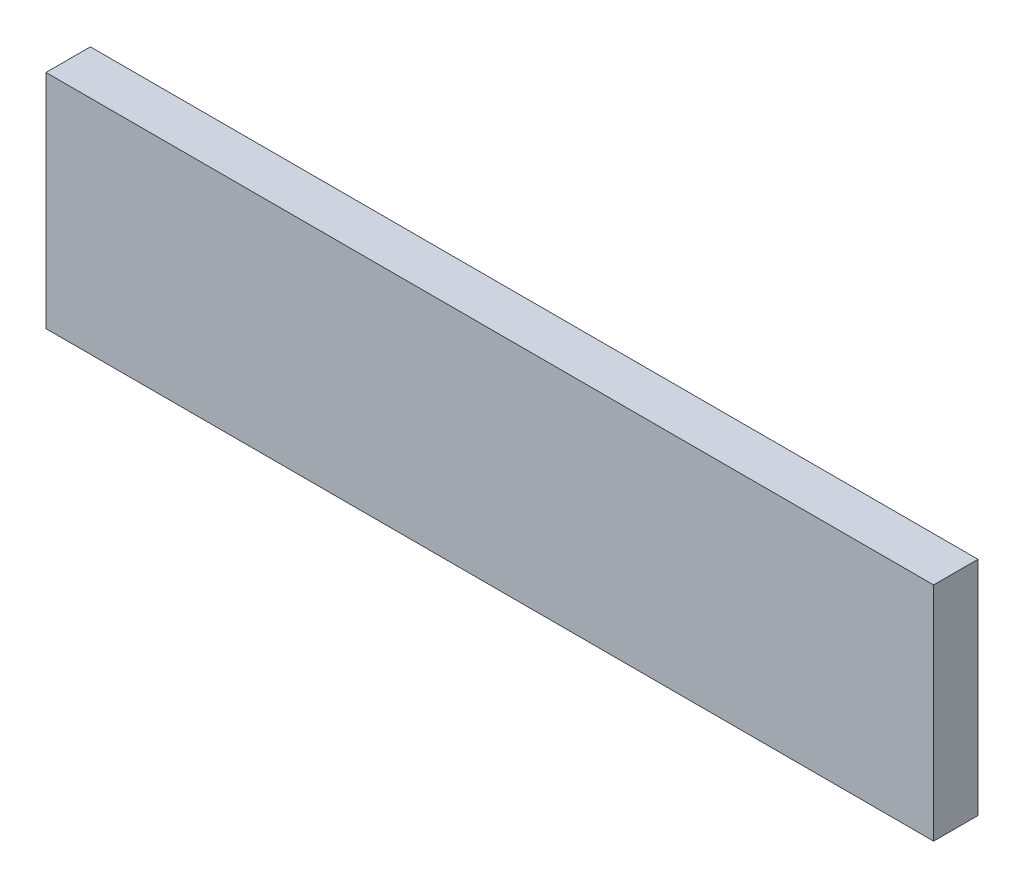
ISO-10303-21;
HEADER;
FILE_DESCRIPTION(('STEP AP214'),'2;1');
FILE_NAME('part.step','',(''),(''),'','','');
FILE_SCHEMA(('AUTOMOTIVE_DESIGN { 1 0 10303 214 1 1 1 1 }'));
ENDSEC;
DATA;
#1=APPLICATION_CONTEXT('core data for automotive mechanical design processes');
#2=APPLICATION_PROTOCOL_DEFINITION('international standard','automotive_design',2000,#1);
#3=PRODUCT_CONTEXT('',#1,'mechanical');
#4=PRODUCT('Part','Part','',(#3));
#5=PRODUCT_RELATED_PRODUCT_CATEGORY('part','',(#4));
#6=PRODUCT_DEFINITION_FORMATION('','',#4);
#7=PRODUCT_DEFINITION_CONTEXT('part definition',#1,'design');
#8=PRODUCT_DEFINITION('design','',#6,#7);
#9=PRODUCT_DEFINITION_SHAPE('','',#8);
#10=(LENGTH_UNIT() NAMED_UNIT(*) SI_UNIT(.MILLI.,.METRE.));
#11=(NAMED_UNIT(*) PLANE_ANGLE_UNIT() SI_UNIT($,.RADIAN.));
#12=(NAMED_UNIT(*) SI_UNIT($,.STERADIAN.) SOLID_ANGLE_UNIT());
#13=UNCERTAINTY_MEASURE_WITH_UNIT(LENGTH_MEASURE(1.E-05),#10,'distance_accuracy_value','');
#14=(GEOMETRIC_REPRESENTATION_CONTEXT(3) GLOBAL_UNCERTAINTY_ASSIGNED_CONTEXT((#13)) GLOBAL_UNIT_ASSIGNED_CONTEXT((#10,
#11,#12)) REPRESENTATION_CONTEXT('',''));
#15=CARTESIAN_POINT('',(0.,0.,0.));
#16=DIRECTION('',(0.,0.,1.));
#17=DIRECTION('',(1.,0.,0.));
#18=AXIS2_PLACEMENT_3D('',#15,#16,#17);
#19=CARTESIAN_POINT('',(63.5,-15.875,6.35));
#20=DIRECTION('',(-1.,0.,0.));
#21=DIRECTION('',(0.,0.,1.));
#22=AXIS2_PLACEMENT_3D('',#19,#20,#21);
#23=PLANE('',#22);
#24=DIRECTION('',(0.,1.,0.));
#25=VECTOR('',#24,1.);
#26=CARTESIAN_POINT('',(63.5,-15.875,0.));
#27=LINE('',#26,#25);
#28=CARTESIAN_POINT('',(63.5,-15.875,0.));
#29=VERTEX_POINT('',#28);
#30=CARTESIAN_POINT('',(63.5,15.875,0.));
#31=VERTEX_POINT('',#30);
#32=EDGE_CURVE('E97',#29,#31,#27,.T.);
#33=ORIENTED_EDGE('',*,*,#32,.T.);
#34=DIRECTION('',(0.,0.,-1.));
#35=VECTOR('',#34,1.);
#36=CARTESIAN_POINT('',(63.5,15.875,6.35));
#37=LINE('',#36,#35);
#38=CARTESIAN_POINT('',(63.5,15.875,6.35));
#39=VERTEX_POINT('',#38);
#40=EDGE_CURVE('E11',#39,#31,#37,.T.);
#41=ORIENTED_EDGE('',*,*,#40,.F.);
#42=DIRECTION('',(0.,1.,0.));
#43=VECTOR('',#42,1.);
#44=CARTESIAN_POINT('',(63.5,-15.875,6.35));
#45=LINE('',#44,#43);
#46=CARTESIAN_POINT('',(63.5,-15.875,6.35));
#47=VERTEX_POINT('',#46);
#48=EDGE_CURVE('E85',#47,#39,#45,.T.);
#49=ORIENTED_EDGE('',*,*,#48,.F.);
#50=DIRECTION('',(0.,0.,-1.));
#51=VECTOR('',#50,1.);
#52=CARTESIAN_POINT('',(63.5,-15.875,6.35));
#53=LINE('',#52,#51);
#54=EDGE_CURVE('E93',#47,#29,#53,.T.);
#55=ORIENTED_EDGE('',*,*,#54,.T.);
#56=EDGE_LOOP('',(#33,#41,#49,#55));
#57=FACE_BOUND('',#56,.T.);
#58=ADVANCED_FACE('F34',(#57),#23,.F.);
#59=CARTESIAN_POINT('',(-63.5,15.875,6.35));
#60=DIRECTION('',(0.,-1.,0.));
#61=DIRECTION('',(0.,0.,-1.));
#62=AXIS2_PLACEMENT_3D('',#59,#60,#61);
#63=PLANE('',#62);
#64=DIRECTION('',(-1.,0.,0.));
#65=VECTOR('',#64,1.);
#66=CARTESIAN_POINT('',(-63.5,15.875,0.));
#67=LINE('',#66,#65);
#68=CARTESIAN_POINT('',(-63.5,15.875,0.));
#69=VERTEX_POINT('',#68);
#70=EDGE_CURVE('E89',#31,#69,#67,.T.);
#71=ORIENTED_EDGE('',*,*,#70,.T.);
#72=DIRECTION('',(0.,0.,-1.));
#73=VECTOR('',#72,1.);
#74=CARTESIAN_POINT('',(-63.5,15.875,6.35));
#75=LINE('',#74,#73);
#76=CARTESIAN_POINT('',(-63.5,15.875,6.35));
#77=VERTEX_POINT('',#76);
#78=EDGE_CURVE('E42',#77,#69,#75,.T.);
#79=ORIENTED_EDGE('',*,*,#78,.F.);
#80=DIRECTION('',(-1.,0.,0.));
#81=VECTOR('',#80,1.);
#82=CARTESIAN_POINT('',(-63.5,15.875,6.35));
#83=LINE('',#82,#81);
#84=EDGE_CURVE('E80',#39,#77,#83,.T.);
#85=ORIENTED_EDGE('',*,*,#84,.F.);
#86=ORIENTED_EDGE('',*,*,#40,.T.);
#87=EDGE_LOOP('',(#71,#79,#85,#86));
#88=FACE_BOUND('',#87,.T.);
#89=ADVANCED_FACE('F88',(#88),#63,.F.);
#90=CARTESIAN_POINT('',(-63.5,-15.875,6.35));
#91=DIRECTION('',(1.,0.,0.));
#92=DIRECTION('',(0.,0.,-1.));
#93=AXIS2_PLACEMENT_3D('',#90,#91,#92);
#94=PLANE('',#93);
#95=DIRECTION('',(0.,-1.,0.));
#96=VECTOR('',#95,1.);
#97=CARTESIAN_POINT('',(-63.5,-15.875,0.));
#98=LINE('',#97,#96);
#99=CARTESIAN_POINT('',(-63.5,-15.875,0.));
#100=VERTEX_POINT('',#99);
#101=EDGE_CURVE('E67',#69,#100,#98,.T.);
#102=ORIENTED_EDGE('',*,*,#101,.T.);
#103=DIRECTION('',(0.,0.,-1.));
#104=VECTOR('',#103,1.);
#105=CARTESIAN_POINT('',(-63.5,-15.875,6.35));
#106=LINE('',#105,#104);
#107=CARTESIAN_POINT('',(-63.5,-15.875,6.35));
#108=VERTEX_POINT('',#107);
#109=EDGE_CURVE('E90',#108,#100,#106,.T.);
#110=ORIENTED_EDGE('',*,*,#109,.F.);
#111=DIRECTION('',(0.,-1.,0.));
#112=VECTOR('',#111,1.);
#113=CARTESIAN_POINT('',(-63.5,-15.875,6.35));
#114=LINE('',#113,#112);
#115=EDGE_CURVE('E83',#77,#108,#114,.T.);
#116=ORIENTED_EDGE('',*,*,#115,.F.);
#117=ORIENTED_EDGE('',*,*,#78,.T.);
#118=EDGE_LOOP('',(#102,#110,#116,#117));
#119=FACE_BOUND('',#118,.T.);
#120=ADVANCED_FACE('F91',(#119),#94,.F.);
#121=CARTESIAN_POINT('',(-63.5,-15.875,6.35));
#122=DIRECTION('',(0.,1.,0.));
#123=DIRECTION('',(0.,0.,1.));
#124=AXIS2_PLACEMENT_3D('',#121,#122,#123);
#125=PLANE('',#124);
#126=DIRECTION('',(1.,0.,0.));
#127=VECTOR('',#126,1.);
#128=CARTESIAN_POINT('',(-63.5,-15.875,0.));
#129=LINE('',#128,#127);
#130=EDGE_CURVE('E73',#100,#29,#129,.T.);
#131=ORIENTED_EDGE('',*,*,#130,.T.);
#132=ORIENTED_EDGE('',*,*,#54,.F.);
#133=DIRECTION('',(1.,0.,0.));
#134=VECTOR('',#133,1.);
#135=CARTESIAN_POINT('',(-63.5,-15.875,6.35));
#136=LINE('',#135,#134);
#137=EDGE_CURVE('E50',#108,#47,#136,.T.);
#138=ORIENTED_EDGE('',*,*,#137,.F.);
#139=ORIENTED_EDGE('',*,*,#109,.T.);
#140=EDGE_LOOP('',(#131,#132,#138,#139));
#141=FACE_BOUND('',#140,.T.);
#142=ADVANCED_FACE('F104',(#141),#125,.F.);
#143=CARTESIAN_POINT('',(0.,0.,6.35));
#144=DIRECTION('',(0.,0.,-1.));
#145=DIRECTION('',(-1.,0.,0.));
#146=AXIS2_PLACEMENT_3D('',#143,#144,#145);
#147=PLANE('',#146);
#148=ORIENTED_EDGE('',*,*,#48,.T.);
#149=ORIENTED_EDGE('',*,*,#84,.T.);
#150=ORIENTED_EDGE('',*,*,#115,.T.);
#151=ORIENTED_EDGE('',*,*,#137,.T.);
#152=EDGE_LOOP('',(#148,#149,#150,#151));
#153=FACE_BOUND('',#152,.T.);
#154=ADVANCED_FACE('F81',(#153),#147,.F.);
#155=CARTESIAN_POINT('',(0.,0.,0.));
#156=DIRECTION('',(0.,0.,-1.));
#157=DIRECTION('',(-1.,0.,0.));
#158=AXIS2_PLACEMENT_3D('',#155,#156,#157);
#159=PLANE('',#158);
#160=ORIENTED_EDGE('',*,*,#32,.F.);
#161=ORIENTED_EDGE('',*,*,#130,.F.);
#162=ORIENTED_EDGE('',*,*,#101,.F.);
#163=ORIENTED_EDGE('',*,*,#70,.F.);
#164=EDGE_LOOP('',(#160,#161,#162,#163));
#165=FACE_BOUND('',#164,.T.);
#166=ADVANCED_FACE('F107',(#165),#159,.T.);
#167=CLOSED_SHELL('',(#58,#89,#120,#142,#154,#166));
#168=MANIFOLD_SOLID_BREP('B2',#167);
#169=ADVANCED_BREP_SHAPE_REPRESENTATION('',(#18,#168),#14);
#170=SHAPE_DEFINITION_REPRESENTATION(#9,#169);
ENDSEC;
END-ISO-10303-21;
